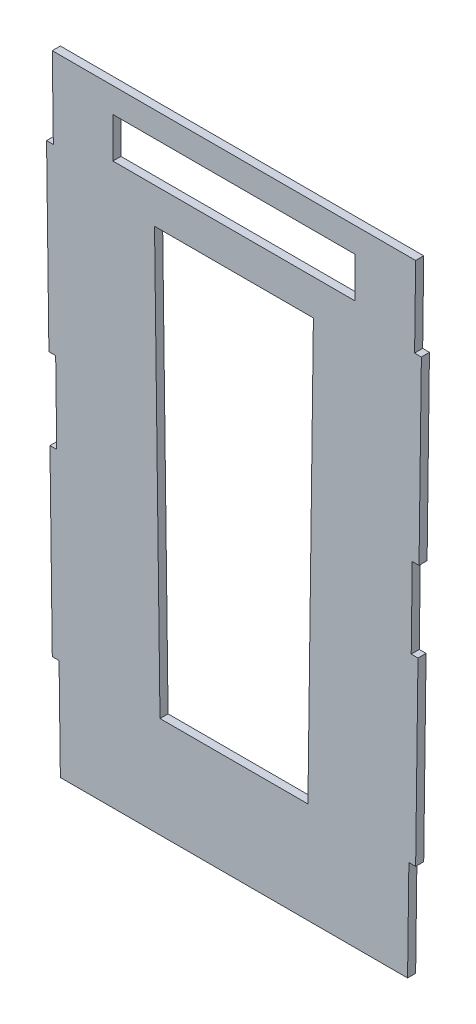
ISO-10303-21;
HEADER;
FILE_DESCRIPTION(('STEP AP214'),'2;1');
FILE_NAME('part.step','',(''),(''),'','','');
FILE_SCHEMA(('AUTOMOTIVE_DESIGN { 1 0 10303 214 1 1 1 1 }'));
ENDSEC;
DATA;
#1=APPLICATION_CONTEXT('core data for automotive mechanical design processes');
#2=APPLICATION_PROTOCOL_DEFINITION('international standard','automotive_design',2000,#1);
#3=PRODUCT_CONTEXT('',#1,'mechanical');
#4=PRODUCT('Part','Part','',(#3));
#5=PRODUCT_RELATED_PRODUCT_CATEGORY('part','',(#4));
#6=PRODUCT_DEFINITION_FORMATION('','',#4);
#7=PRODUCT_DEFINITION_CONTEXT('part definition',#1,'design');
#8=PRODUCT_DEFINITION('design','',#6,#7);
#9=PRODUCT_DEFINITION_SHAPE('','',#8);
#10=(LENGTH_UNIT() NAMED_UNIT(*) SI_UNIT(.MILLI.,.METRE.));
#11=(NAMED_UNIT(*) PLANE_ANGLE_UNIT() SI_UNIT($,.RADIAN.));
#12=(NAMED_UNIT(*) SI_UNIT($,.STERADIAN.) SOLID_ANGLE_UNIT());
#13=UNCERTAINTY_MEASURE_WITH_UNIT(LENGTH_MEASURE(1.E-05),#10,'distance_accuracy_value','');
#14=(GEOMETRIC_REPRESENTATION_CONTEXT(3) GLOBAL_UNCERTAINTY_ASSIGNED_CONTEXT((#13)) GLOBAL_UNIT_ASSIGNED_CONTEXT((#10,
#11,#12)) REPRESENTATION_CONTEXT('',''));
#15=CARTESIAN_POINT('',(0.,0.,0.));
#16=DIRECTION('',(0.,0.,1.));
#17=DIRECTION('',(1.,0.,0.));
#18=AXIS2_PLACEMENT_3D('',#15,#16,#17);
#19=CARTESIAN_POINT('',(-1.61230948984664E-12,-64.9945896453371,2.));
#20=DIRECTION('',(0.,1.,0.));
#21=DIRECTION('',(-1.,0.,0.));
#22=AXIS2_PLACEMENT_3D('',#19,#20,#21);
#23=PLANE('',#22);
#24=DIRECTION('',(1.,0.,0.));
#25=VECTOR('',#24,1.);
#26=CARTESIAN_POINT('',(-1.61230948984664E-12,-64.9945896453371,0.));
#27=LINE('',#26,#25);
#28=CARTESIAN_POINT('',(-0.837659874682009,-64.9945896453371,0.));
#29=VERTEX_POINT('',#28);
#30=CARTESIAN_POINT('',(0.839480171112013,-64.9945896453371,0.));
#31=VERTEX_POINT('',#30);
#32=EDGE_CURVE('E374',#29,#31,#27,.T.);
#33=ORIENTED_EDGE('',*,*,#32,.T.);
#34=DIRECTION('',(0.,0.,-1.));
#35=VECTOR('',#34,1.);
#36=CARTESIAN_POINT('',(0.839480171112013,-64.9945896453371,2.));
#37=LINE('',#36,#35);
#38=CARTESIAN_POINT('',(0.839480171112013,-64.9945896453371,2.));
#39=VERTEX_POINT('',#38);
#40=EDGE_CURVE('E11',#39,#31,#37,.T.);
#41=ORIENTED_EDGE('',*,*,#40,.F.);
#42=DIRECTION('',(1.,0.,0.));
#43=VECTOR('',#42,1.);
#44=CARTESIAN_POINT('',(-1.61230948984664E-12,-64.9945896453371,2.));
#45=LINE('',#44,#43);
#46=CARTESIAN_POINT('',(-0.837659874682009,-64.9945896453371,2.));
#47=VERTEX_POINT('',#46);
#48=EDGE_CURVE('E262',#47,#39,#45,.T.);
#49=ORIENTED_EDGE('',*,*,#48,.F.);
#50=DIRECTION('',(0.,0.,-1.));
#51=VECTOR('',#50,1.);
#52=CARTESIAN_POINT('',(-0.837659874682009,-64.9945896453371,2.));
#53=LINE('',#52,#51);
#54=EDGE_CURVE('E293',#47,#29,#53,.T.);
#55=ORIENTED_EDGE('',*,*,#54,.T.);
#56=EDGE_LOOP('',(#33,#41,#49,#55));
#57=FACE_BOUND('',#56,.T.);
#58=ADVANCED_FACE('F36',(#57),#23,.F.);
#59=CARTESIAN_POINT('',(0.,0.,2.));
#60=DIRECTION('',(-0.999916596909834,-0.0129150774003207,0.));
#61=DIRECTION('',(0.0129150774003207,-0.999916596909834,0.));
#62=AXIS2_PLACEMENT_3D('',#59,#60,#61);
#63=PLANE('',#62);
#64=DIRECTION('',(-0.0129150774003207,0.999916596909834,0.));
#65=VECTOR('',#64,1.);
#66=CARTESIAN_POINT('',(0.,0.,0.));
#67=LINE('',#66,#65);
#68=CARTESIAN_POINT('',(1.09780326406264,-84.9945896453372,0.));
#69=VERTEX_POINT('',#68);
#70=EDGE_CURVE('E377',#69,#31,#67,.T.);
#71=ORIENTED_EDGE('',*,*,#70,.F.);
#72=DIRECTION('',(0.,0.,-1.));
#73=VECTOR('',#72,1.);
#74=CARTESIAN_POINT('',(1.09780326406264,-84.9945896453372,2.));
#75=LINE('',#74,#73);
#76=CARTESIAN_POINT('',(1.09780326406264,-84.9945896453372,2.));
#77=VERTEX_POINT('',#76);
#78=EDGE_CURVE('E46',#77,#69,#75,.T.);
#79=ORIENTED_EDGE('',*,*,#78,.F.);
#80=DIRECTION('',(-0.0129150774003207,0.999916596909834,0.));
#81=VECTOR('',#80,1.);
#82=CARTESIAN_POINT('',(0.,0.,2.));
#83=LINE('',#82,#81);
#84=EDGE_CURVE('E252',#77,#39,#83,.T.);
#85=ORIENTED_EDGE('',*,*,#84,.T.);
#86=ORIENTED_EDGE('',*,*,#40,.T.);
#87=EDGE_LOOP('',(#71,#79,#85,#86));
#88=FACE_BOUND('',#87,.T.);
#89=ADVANCED_FACE('F479',(#88),#63,.T.);
#90=CARTESIAN_POINT('',(0.,-84.9945896453372,2.));
#91=DIRECTION('',(0.,1.,0.));
#92=DIRECTION('',(0.,0.,1.));
#93=AXIS2_PLACEMENT_3D('',#90,#91,#92);
#94=PLANE('',#93);
#95=DIRECTION('',(1.,0.,0.));
#96=VECTOR('',#95,1.);
#97=CARTESIAN_POINT('',(0.,-84.9945896453372,0.));
#98=LINE('',#97,#96);
#99=CARTESIAN_POINT('',(-0.579595356949847,-84.9945896453372,0.));
#100=VERTEX_POINT('',#99);
#101=EDGE_CURVE('E380',#100,#69,#98,.T.);
#102=ORIENTED_EDGE('',*,*,#101,.F.);
#103=DIRECTION('',(0.,0.,-1.));
#104=VECTOR('',#103,1.);
#105=CARTESIAN_POINT('',(-0.579595356949847,-84.9945896453372,2.));
#106=LINE('',#105,#104);
#107=CARTESIAN_POINT('',(-0.579595356949847,-84.9945896453372,2.));
#108=VERTEX_POINT('',#107);
#109=EDGE_CURVE('E325',#108,#100,#106,.T.);
#110=ORIENTED_EDGE('',*,*,#109,.F.);
#111=DIRECTION('',(1.,0.,0.));
#112=VECTOR('',#111,1.);
#113=CARTESIAN_POINT('',(0.,-84.9945896453372,2.));
#114=LINE('',#113,#112);
#115=EDGE_CURVE('E261',#108,#77,#114,.T.);
#116=ORIENTED_EDGE('',*,*,#115,.T.);
#117=ORIENTED_EDGE('',*,*,#78,.T.);
#118=EDGE_LOOP('',(#102,#110,#116,#117));
#119=FACE_BOUND('',#118,.T.);
#120=ADVANCED_FACE('F477',(#119),#94,.T.);
#121=CARTESIAN_POINT('',(-1.67602070016952,-0.0216260736849209,2.));
#122=DIRECTION('',(0.999916763774417,0.0129021518707889,0.));
#123=DIRECTION('',(-0.0129021518707889,0.999916763774417,0.));
#124=AXIS2_PLACEMENT_3D('',#121,#122,#123);
#125=PLANE('',#124);
#126=DIRECTION('',(0.0129021518707889,-0.999916763774417,0.));
#127=VECTOR('',#126,1.);
#128=CARTESIAN_POINT('',(-1.67602070016952,-0.0216260736849209,0.));
#129=LINE('',#128,#127);
#130=CARTESIAN_POINT('',(0.00100147723565425,-129.990844015186,0.));
#131=VERTEX_POINT('',#130);
#132=EDGE_CURVE('E384',#100,#131,#129,.T.);
#133=ORIENTED_EDGE('',*,*,#132,.T.);
#134=DIRECTION('',(0.,0.,-1.));
#135=VECTOR('',#134,1.);
#136=CARTESIAN_POINT('',(0.00100147723565425,-129.990844015186,2.));
#137=LINE('',#136,#135);
#138=CARTESIAN_POINT('',(0.00100147723565425,-129.990844015186,2.));
#139=VERTEX_POINT('',#138);
#140=EDGE_CURVE('E322',#139,#131,#137,.T.);
#141=ORIENTED_EDGE('',*,*,#140,.F.);
#142=DIRECTION('',(0.0129021518707889,-0.999916763774417,0.));
#143=VECTOR('',#142,1.);
#144=CARTESIAN_POINT('',(-1.67602070016952,-0.0216260736849209,2.));
#145=LINE('',#144,#143);
#146=EDGE_CURVE('E266',#108,#139,#145,.T.);
#147=ORIENTED_EDGE('',*,*,#146,.F.);
#148=ORIENTED_EDGE('',*,*,#109,.T.);
#149=EDGE_LOOP('',(#133,#141,#147,#148));
#150=FACE_BOUND('',#149,.T.);
#151=ADVANCED_FACE('F473',(#150),#125,.F.);
#152=CARTESIAN_POINT('',(0.,-129.990844015186,2.));
#153=DIRECTION('',(0.,1.,0.));
#154=DIRECTION('',(0.,0.,1.));
#155=AXIS2_PLACEMENT_3D('',#152,#153,#154);
#156=PLANE('',#155);
#157=DIRECTION('',(1.,0.,0.));
#158=VECTOR('',#157,1.);
#159=CARTESIAN_POINT('',(0.,-129.990844015186,0.));
#160=LINE('',#159,#158);
#161=CARTESIAN_POINT('',(1.67898184406326,-129.990844015186,0.));
#162=VERTEX_POINT('',#161);
#163=EDGE_CURVE('E386',#131,#162,#160,.T.);
#164=ORIENTED_EDGE('',*,*,#163,.T.);
#165=DIRECTION('',(0.,0.,-1.));
#166=VECTOR('',#165,1.);
#167=CARTESIAN_POINT('',(1.67898184406326,-129.990844015186,2.));
#168=LINE('',#167,#166);
#169=CARTESIAN_POINT('',(1.67898184406326,-129.990844015186,2.));
#170=VERTEX_POINT('',#169);
#171=EDGE_CURVE('E320',#170,#162,#168,.T.);
#172=ORIENTED_EDGE('',*,*,#171,.F.);
#173=DIRECTION('',(1.,0.,0.));
#174=VECTOR('',#173,1.);
#175=CARTESIAN_POINT('',(0.,-129.990844015186,2.));
#176=LINE('',#175,#174);
#177=EDGE_CURVE('E259',#139,#170,#176,.T.);
#178=ORIENTED_EDGE('',*,*,#177,.F.);
#179=ORIENTED_EDGE('',*,*,#140,.T.);
#180=EDGE_LOOP('',(#164,#172,#178,#179));
#181=FACE_BOUND('',#180,.T.);
#182=ADVANCED_FACE('F469',(#181),#156,.F.);
#183=CARTESIAN_POINT('',(2.00100147723566,-154.922384551822,0.));
#184=VERTEX_POINT('',#183);
#185=EDGE_CURVE('E381',#184,#162,#67,.T.);
#186=ORIENTED_EDGE('',*,*,#185,.F.);
#187=DIRECTION('',(0.,0.,-1.));
#188=VECTOR('',#187,1.);
#189=CARTESIAN_POINT('',(2.00100147723566,-154.922384551822,2.));
#190=LINE('',#189,#188);
#191=CARTESIAN_POINT('',(2.00100147723566,-154.922384551822,2.));
#192=VERTEX_POINT('',#191);
#193=EDGE_CURVE('E318',#192,#184,#190,.T.);
#194=ORIENTED_EDGE('',*,*,#193,.F.);
#195=EDGE_CURVE('E251',#192,#170,#83,.T.);
#196=ORIENTED_EDGE('',*,*,#195,.T.);
#197=ORIENTED_EDGE('',*,*,#171,.T.);
#198=EDGE_LOOP('',(#186,#194,#196,#197));
#199=FACE_BOUND('',#198,.T.);
#200=ADVANCED_FACE('F464',(#199),#63,.T.);
#201=CARTESIAN_POINT('',(0.,-154.922384551822,2.));
#202=DIRECTION('',(0.,-1.,0.));
#203=DIRECTION('',(0.,0.,-1.));
#204=AXIS2_PLACEMENT_3D('',#201,#202,#203);
#205=PLANE('',#204);
#206=DIRECTION('',(-1.,0.,0.));
#207=VECTOR('',#206,1.);
#208=CARTESIAN_POINT('',(0.,-154.922384551822,0.));
#209=LINE('',#208,#207);
#210=CARTESIAN_POINT('',(88.0010014772356,-154.922384551822,0.));
#211=VERTEX_POINT('',#210);
#212=EDGE_CURVE('E389',#211,#184,#209,.T.);
#213=ORIENTED_EDGE('',*,*,#212,.F.);
#214=DIRECTION('',(0.,0.,-1.));
#215=VECTOR('',#214,1.);
#216=CARTESIAN_POINT('',(88.0010014772356,-154.922384551822,2.));
#217=LINE('',#216,#215);
#218=CARTESIAN_POINT('',(88.0010014772356,-154.922384551822,2.));
#219=VERTEX_POINT('',#218);
#220=EDGE_CURVE('E316',#219,#211,#217,.T.);
#221=ORIENTED_EDGE('',*,*,#220,.F.);
#222=DIRECTION('',(-1.,0.,0.));
#223=VECTOR('',#222,1.);
#224=CARTESIAN_POINT('',(0.,-154.922384551822,2.));
#225=LINE('',#224,#223);
#226=EDGE_CURVE('E258',#219,#192,#225,.T.);
#227=ORIENTED_EDGE('',*,*,#226,.T.);
#228=ORIENTED_EDGE('',*,*,#193,.T.);
#229=EDGE_LOOP('',(#213,#221,#227,#228));
#230=FACE_BOUND('',#229,.T.);
#231=ADVANCED_FACE('F458',(#230),#205,.T.);
#232=CARTESIAN_POINT('',(89.9850181029393,-1.16109701499287,2.));
#233=DIRECTION('',(0.999916763774417,-0.0129021518707889,0.));
#234=DIRECTION('',(0.0129021518707889,0.999916763774417,0.));
#235=AXIS2_PLACEMENT_3D('',#232,#233,#234);
#236=PLANE('',#235);
#237=DIRECTION('',(-0.0129021518707889,-0.999916763774417,0.));
#238=VECTOR('',#237,1.);
#239=CARTESIAN_POINT('',(89.9850181029393,-1.16109701499287,0.));
#240=LINE('',#239,#238);
#241=CARTESIAN_POINT('',(88.322698776481,-129.990844015186,0.));
#242=VERTEX_POINT('',#241);
#243=EDGE_CURVE('E392',#242,#211,#240,.T.);
#244=ORIENTED_EDGE('',*,*,#243,.F.);
#245=DIRECTION('',(0.,0.,-1.));
#246=VECTOR('',#245,1.);
#247=CARTESIAN_POINT('',(88.322698776481,-129.990844015186,2.));
#248=LINE('',#247,#246);
#249=CARTESIAN_POINT('',(88.322698776481,-129.990844015186,2.));
#250=VERTEX_POINT('',#249);
#251=EDGE_CURVE('E314',#250,#242,#248,.T.);
#252=ORIENTED_EDGE('',*,*,#251,.F.);
#253=DIRECTION('',(-0.0129021518707889,-0.999916763774417,0.));
#254=VECTOR('',#253,1.);
#255=CARTESIAN_POINT('',(89.9850181029393,-1.16109701499287,2.));
#256=LINE('',#255,#254);
#257=EDGE_CURVE('E454',#250,#219,#256,.T.);
#258=ORIENTED_EDGE('',*,*,#257,.T.);
#259=ORIENTED_EDGE('',*,*,#220,.T.);
#260=EDGE_LOOP('',(#244,#252,#258,#259));
#261=FACE_BOUND('',#260,.T.);
#262=ADVANCED_FACE('F452',(#261),#236,.T.);
#263=CARTESIAN_POINT('',(0.,-129.990844015186,2.));
#264=DIRECTION('',(0.,-1.,0.));
#265=DIRECTION('',(0.,0.,-1.));
#266=AXIS2_PLACEMENT_3D('',#263,#264,#265);
#267=PLANE('',#266);
#268=DIRECTION('',(-1.,0.,0.));
#269=VECTOR('',#268,1.);
#270=CARTESIAN_POINT('',(0.,-129.990844015186,0.));
#271=LINE('',#270,#269);
#272=CARTESIAN_POINT('',(90.0010014772356,-129.990844015186,0.));
#273=VERTEX_POINT('',#272);
#274=EDGE_CURVE('E395',#273,#242,#271,.T.);
#275=ORIENTED_EDGE('',*,*,#274,.F.);
#276=DIRECTION('',(0.,0.,-1.));
#277=VECTOR('',#276,1.);
#278=CARTESIAN_POINT('',(90.0010014772356,-129.990844015186,2.));
#279=LINE('',#278,#277);
#280=CARTESIAN_POINT('',(90.0010014772356,-129.990844015186,2.));
#281=VERTEX_POINT('',#280);
#282=EDGE_CURVE('E312',#281,#273,#279,.T.);
#283=ORIENTED_EDGE('',*,*,#282,.F.);
#284=DIRECTION('',(-1.,0.,0.));
#285=VECTOR('',#284,1.);
#286=CARTESIAN_POINT('',(0.,-129.990844015186,2.));
#287=LINE('',#286,#285);
#288=EDGE_CURVE('E448',#281,#250,#287,.T.);
#289=ORIENTED_EDGE('',*,*,#288,.T.);
#290=ORIENTED_EDGE('',*,*,#251,.T.);
#291=EDGE_LOOP('',(#275,#283,#289,#290));
#292=FACE_BOUND('',#291,.T.);
#293=ADVANCED_FACE('F445',(#292),#267,.T.);
#294=CARTESIAN_POINT('',(91.6630414241572,-1.18274892894955,2.));
#295=DIRECTION('',(0.999916763774417,-0.0129021518707889,0.));
#296=DIRECTION('',(0.0129021518707889,0.999916763774417,0.));
#297=AXIS2_PLACEMENT_3D('',#294,#295,#296);
#298=PLANE('',#297);
#299=DIRECTION('',(-0.0129021518707889,-0.999916763774417,0.));
#300=VECTOR('',#299,1.);
#301=CARTESIAN_POINT('',(91.6630414241572,-1.18274892894955,0.));
#302=LINE('',#301,#300);
#303=CARTESIAN_POINT('',(90.5815983114211,-84.9945896453371,0.));
#304=VERTEX_POINT('',#303);
#305=EDGE_CURVE('E400',#304,#273,#302,.T.);
#306=ORIENTED_EDGE('',*,*,#305,.F.);
#307=DIRECTION('',(0.,0.,-1.));
#308=VECTOR('',#307,1.);
#309=CARTESIAN_POINT('',(90.5815983114211,-84.9945896453371,2.));
#310=LINE('',#309,#308);
#311=CARTESIAN_POINT('',(90.5815983114211,-84.9945896453371,2.));
#312=VERTEX_POINT('',#311);
#313=EDGE_CURVE('E310',#312,#304,#310,.T.);
#314=ORIENTED_EDGE('',*,*,#313,.F.);
#315=DIRECTION('',(-0.0129021518707889,-0.999916763774417,0.));
#316=VECTOR('',#315,1.);
#317=CARTESIAN_POINT('',(91.6630414241572,-1.18274892894955,2.));
#318=LINE('',#317,#316);
#319=EDGE_CURVE('E441',#312,#281,#318,.T.);
#320=ORIENTED_EDGE('',*,*,#319,.T.);
#321=ORIENTED_EDGE('',*,*,#282,.T.);
#322=EDGE_LOOP('',(#306,#314,#320,#321));
#323=FACE_BOUND('',#322,.T.);
#324=ADVANCED_FACE('F440',(#323),#298,.T.);
#325=CARTESIAN_POINT('',(0.,-84.9945896453371,2.));
#326=DIRECTION('',(0.,-1.,0.));
#327=DIRECTION('',(0.,0.,-1.));
#328=AXIS2_PLACEMENT_3D('',#325,#326,#327);
#329=PLANE('',#328);
#330=DIRECTION('',(-1.,0.,0.));
#331=VECTOR('',#330,1.);
#332=CARTESIAN_POINT('',(0.,-84.9945896453371,0.));
#333=LINE('',#332,#331);
#334=CARTESIAN_POINT('',(88.9032956106665,-84.9945896453371,0.));
#335=VERTEX_POINT('',#334);
#336=EDGE_CURVE('E403',#304,#335,#333,.T.);
#337=ORIENTED_EDGE('',*,*,#336,.T.);
#338=DIRECTION('',(0.,0.,-1.));
#339=VECTOR('',#338,1.);
#340=CARTESIAN_POINT('',(88.9032956106665,-84.9945896453371,2.));
#341=LINE('',#340,#339);
#342=CARTESIAN_POINT('',(88.9032956106665,-84.9945896453371,2.));
#343=VERTEX_POINT('',#342);
#344=EDGE_CURVE('E308',#343,#335,#341,.T.);
#345=ORIENTED_EDGE('',*,*,#344,.F.);
#346=DIRECTION('',(-1.,0.,0.));
#347=VECTOR('',#346,1.);
#348=CARTESIAN_POINT('',(0.,-84.9945896453371,2.));
#349=LINE('',#348,#347);
#350=EDGE_CURVE('E436',#312,#343,#349,.T.);
#351=ORIENTED_EDGE('',*,*,#350,.F.);
#352=ORIENTED_EDGE('',*,*,#313,.T.);
#353=EDGE_LOOP('',(#337,#345,#351,#352));
#354=FACE_BOUND('',#353,.T.);
#355=ADVANCED_FACE('F435',(#354),#329,.F.);
#356=CARTESIAN_POINT('',(89.1613601283987,-64.9945896453371,0.));
#357=VERTEX_POINT('',#356);
#358=EDGE_CURVE('E397',#357,#335,#240,.T.);
#359=ORIENTED_EDGE('',*,*,#358,.F.);
#360=DIRECTION('',(0.,0.,-1.));
#361=VECTOR('',#360,1.);
#362=CARTESIAN_POINT('',(89.1613601283987,-64.9945896453371,2.));
#363=LINE('',#362,#361);
#364=CARTESIAN_POINT('',(89.1613601283987,-64.9945896453371,2.));
#365=VERTEX_POINT('',#364);
#366=EDGE_CURVE('E306',#365,#357,#363,.T.);
#367=ORIENTED_EDGE('',*,*,#366,.F.);
#368=EDGE_CURVE('E432',#365,#343,#256,.T.);
#369=ORIENTED_EDGE('',*,*,#368,.T.);
#370=ORIENTED_EDGE('',*,*,#344,.T.);
#371=EDGE_LOOP('',(#359,#367,#369,#370));
#372=FACE_BOUND('',#371,.T.);
#373=ADVANCED_FACE('F428',(#372),#236,.T.);
#374=CARTESIAN_POINT('',(-5.37436496615532E-13,-64.9945896453364,2.));
#375=DIRECTION('',(0.,-1.,0.));
#376=DIRECTION('',(1.,0.,0.));
#377=AXIS2_PLACEMENT_3D('',#374,#375,#376);
#378=PLANE('',#377);
#379=DIRECTION('',(-1.,0.,0.));
#380=VECTOR('',#379,1.);
#381=CARTESIAN_POINT('',(-5.37436496615532E-13,-64.9945896453364,0.));
#382=LINE('',#381,#380);
#383=CARTESIAN_POINT('',(90.8396628291533,-64.9945896453371,0.));
#384=VERTEX_POINT('',#383);
#385=EDGE_CURVE('E406',#384,#357,#382,.T.);
#386=ORIENTED_EDGE('',*,*,#385,.F.);
#387=DIRECTION('',(0.,0.,-1.));
#388=VECTOR('',#387,1.);
#389=CARTESIAN_POINT('',(90.8396628291533,-64.9945896453371,2.));
#390=LINE('',#389,#388);
#391=CARTESIAN_POINT('',(90.8396628291533,-64.9945896453371,2.));
#392=VERTEX_POINT('',#391);
#393=EDGE_CURVE('E304',#392,#384,#390,.T.);
#394=ORIENTED_EDGE('',*,*,#393,.F.);
#395=DIRECTION('',(-1.,0.,0.));
#396=VECTOR('',#395,1.);
#397=CARTESIAN_POINT('',(-5.37436496615532E-13,-64.9945896453364,2.));
#398=LINE('',#397,#396);
#399=EDGE_CURVE('E807',#392,#365,#398,.T.);
#400=ORIENTED_EDGE('',*,*,#399,.T.);
#401=ORIENTED_EDGE('',*,*,#366,.T.);
#402=EDGE_LOOP('',(#386,#394,#400,#401));
#403=FACE_BOUND('',#402,.T.);
#404=ADVANCED_FACE('F580',(#403),#378,.T.);
#405=CARTESIAN_POINT('',(91.6630414241572,-1.18274892894952,2.));
#406=DIRECTION('',(0.999916763774417,-0.0129021518707886,0.));
#407=DIRECTION('',(0.0129021518707886,0.999916763774417,0.));
#408=AXIS2_PLACEMENT_3D('',#405,#406,#407);
#409=PLANE('',#408);
#410=DIRECTION('',(-0.0129021518707886,-0.999916763774417,0.));
#411=VECTOR('',#410,1.);
#412=CARTESIAN_POINT('',(91.6630414241572,-1.18274892894952,0.));
#413=LINE('',#412,#411);
#414=CARTESIAN_POINT('',(91.4202596633388,-19.9983352754883,0.));
#415=VERTEX_POINT('',#414);
#416=EDGE_CURVE('E409',#415,#384,#413,.T.);
#417=ORIENTED_EDGE('',*,*,#416,.F.);
#418=DIRECTION('',(0.,0.,-1.));
#419=VECTOR('',#418,1.);
#420=CARTESIAN_POINT('',(91.4202596633388,-19.9983352754883,2.));
#421=LINE('',#420,#419);
#422=CARTESIAN_POINT('',(91.4202596633388,-19.9983352754883,2.));
#423=VERTEX_POINT('',#422);
#424=EDGE_CURVE('E302',#423,#415,#421,.T.);
#425=ORIENTED_EDGE('',*,*,#424,.F.);
#426=DIRECTION('',(-0.0129021518707886,-0.999916763774417,0.));
#427=VECTOR('',#426,1.);
#428=CARTESIAN_POINT('',(91.6630414241572,-1.18274892894952,2.));
#429=LINE('',#428,#427);
#430=EDGE_CURVE('E803',#423,#392,#429,.T.);
#431=ORIENTED_EDGE('',*,*,#430,.T.);
#432=ORIENTED_EDGE('',*,*,#393,.T.);
#433=EDGE_LOOP('',(#417,#425,#431,#432));
#434=FACE_BOUND('',#433,.T.);
#435=ADVANCED_FACE('F572',(#434),#409,.T.);
#436=CARTESIAN_POINT('',(0.,-19.9983352754883,2.));
#437=DIRECTION('',(0.,1.,0.));
#438=DIRECTION('',(0.,0.,1.));
#439=AXIS2_PLACEMENT_3D('',#436,#437,#438);
#440=PLANE('',#439);
#441=DIRECTION('',(1.,0.,0.));
#442=VECTOR('',#441,1.);
#443=CARTESIAN_POINT('',(0.,-19.9983352754883,0.));
#444=LINE('',#443,#442);
#445=CARTESIAN_POINT('',(89.7419569625842,-19.9983352754883,0.));
#446=VERTEX_POINT('',#445);
#447=EDGE_CURVE('E412',#446,#415,#444,.T.);
#448=ORIENTED_EDGE('',*,*,#447,.F.);
#449=DIRECTION('',(0.,0.,-1.));
#450=VECTOR('',#449,1.);
#451=CARTESIAN_POINT('',(89.7419569625842,-19.9983352754883,2.));
#452=LINE('',#451,#450);
#453=CARTESIAN_POINT('',(89.7419569625842,-19.9983352754883,2.));
#454=VERTEX_POINT('',#453);
#455=EDGE_CURVE('E300',#454,#446,#452,.T.);
#456=ORIENTED_EDGE('',*,*,#455,.F.);
#457=DIRECTION('',(1.,0.,0.));
#458=VECTOR('',#457,1.);
#459=CARTESIAN_POINT('',(0.,-19.9983352754883,2.));
#460=LINE('',#459,#458);
#461=EDGE_CURVE('E806',#454,#423,#460,.T.);
#462=ORIENTED_EDGE('',*,*,#461,.T.);
#463=ORIENTED_EDGE('',*,*,#424,.T.);
#464=EDGE_LOOP('',(#448,#456,#462,#463));
#465=FACE_BOUND('',#464,.T.);
#466=ADVANCED_FACE('F564',(#465),#440,.T.);
#467=CARTESIAN_POINT('',(90.,0.,0.));
#468=VERTEX_POINT('',#467);
#469=EDGE_CURVE('E396',#468,#446,#240,.T.);
#470=ORIENTED_EDGE('',*,*,#469,.F.);
#471=DIRECTION('',(0.,0.,-1.));
#472=VECTOR('',#471,1.);
#473=CARTESIAN_POINT('',(90.,0.,2.));
#474=LINE('',#473,#472);
#475=CARTESIAN_POINT('',(90.,0.,2.));
#476=VERTEX_POINT('',#475);
#477=EDGE_CURVE('E298',#476,#468,#474,.T.);
#478=ORIENTED_EDGE('',*,*,#477,.F.);
#479=EDGE_CURVE('E253',#476,#454,#256,.T.);
#480=ORIENTED_EDGE('',*,*,#479,.T.);
#481=ORIENTED_EDGE('',*,*,#455,.T.);
#482=EDGE_LOOP('',(#470,#478,#480,#481));
#483=FACE_BOUND('',#482,.T.);
#484=ADVANCED_FACE('F556',(#483),#236,.T.);
#485=CARTESIAN_POINT('',(0.,0.,2.));
#486=DIRECTION('',(0.,1.,0.));
#487=DIRECTION('',(0.,0.,1.));
#488=AXIS2_PLACEMENT_3D('',#485,#486,#487);
#489=PLANE('',#488);
#490=DIRECTION('',(1.,0.,0.));
#491=VECTOR('',#490,1.);
#492=CARTESIAN_POINT('',(0.,0.,0.));
#493=LINE('',#492,#491);
#494=CARTESIAN_POINT('',(0.,0.,0.));
#495=VERTEX_POINT('',#494);
#496=EDGE_CURVE('E414',#495,#468,#493,.T.);
#497=ORIENTED_EDGE('',*,*,#496,.F.);
#498=DIRECTION('',(0.,0.,-1.));
#499=VECTOR('',#498,1.);
#500=CARTESIAN_POINT('',(0.,0.,2.));
#501=LINE('',#500,#499);
#502=CARTESIAN_POINT('',(0.,0.,2.));
#503=VERTEX_POINT('',#502);
#504=EDGE_CURVE('E239',#503,#495,#501,.T.);
#505=ORIENTED_EDGE('',*,*,#504,.F.);
#506=DIRECTION('',(1.,0.,0.));
#507=VECTOR('',#506,1.);
#508=CARTESIAN_POINT('',(0.,0.,2.));
#509=LINE('',#508,#507);
#510=EDGE_CURVE('E249',#503,#476,#509,.T.);
#511=ORIENTED_EDGE('',*,*,#510,.T.);
#512=ORIENTED_EDGE('',*,*,#477,.T.);
#513=EDGE_LOOP('',(#497,#505,#511,#512));
#514=FACE_BOUND('',#513,.T.);
#515=ADVANCED_FACE('F550',(#514),#489,.T.);
#516=CARTESIAN_POINT('',(0.25830159111139,-19.9983352754885,0.));
#517=VERTEX_POINT('',#516);
#518=EDGE_CURVE('E238',#517,#495,#67,.T.);
#519=ORIENTED_EDGE('',*,*,#518,.F.);
#520=DIRECTION('',(0.,0.,-1.));
#521=VECTOR('',#520,1.);
#522=CARTESIAN_POINT('',(0.25830159111139,-19.9983352754885,2.));
#523=LINE('',#522,#521);
#524=CARTESIAN_POINT('',(0.25830159111139,-19.9983352754885,2.));
#525=VERTEX_POINT('',#524);
#526=EDGE_CURVE('E232',#525,#517,#523,.T.);
#527=ORIENTED_EDGE('',*,*,#526,.F.);
#528=EDGE_CURVE('E236',#525,#503,#83,.T.);
#529=ORIENTED_EDGE('',*,*,#528,.T.);
#530=ORIENTED_EDGE('',*,*,#504,.T.);
#531=EDGE_LOOP('',(#519,#527,#529,#530));
#532=FACE_BOUND('',#531,.T.);
#533=ADVANCED_FACE('F234',(#532),#63,.T.);
#534=CARTESIAN_POINT('',(-1.32292060705367E-12,-19.9983352754884,2.));
#535=DIRECTION('',(0.,-1.,0.));
#536=DIRECTION('',(1.,0.,0.));
#537=AXIS2_PLACEMENT_3D('',#534,#535,#536);
#538=PLANE('',#537);
#539=DIRECTION('',(-1.,0.,0.));
#540=VECTOR('',#539,1.);
#541=CARTESIAN_POINT('',(-1.32292060705367E-12,-19.9983352754884,0.));
#542=LINE('',#541,#540);
#543=CARTESIAN_POINT('',(-1.4182567088675,-19.9983352754883,0.));
#544=VERTEX_POINT('',#543);
#545=EDGE_CURVE('E142',#517,#544,#542,.T.);
#546=ORIENTED_EDGE('',*,*,#545,.T.);
#547=DIRECTION('',(0.,0.,-1.));
#548=VECTOR('',#547,1.);
#549=CARTESIAN_POINT('',(-1.4182567088675,-19.9983352754883,2.));
#550=LINE('',#549,#548);
#551=CARTESIAN_POINT('',(-1.4182567088675,-19.9983352754883,2.));
#552=VERTEX_POINT('',#551);
#553=EDGE_CURVE('E240',#552,#544,#550,.T.);
#554=ORIENTED_EDGE('',*,*,#553,.F.);
#555=DIRECTION('',(-1.,0.,0.));
#556=VECTOR('',#555,1.);
#557=CARTESIAN_POINT('',(-1.32292060705367E-12,-19.9983352754884,2.));
#558=LINE('',#557,#556);
#559=EDGE_CURVE('E242',#525,#552,#558,.T.);
#560=ORIENTED_EDGE('',*,*,#559,.F.);
#561=ORIENTED_EDGE('',*,*,#526,.T.);
#562=EDGE_LOOP('',(#546,#554,#560,#561));
#563=FACE_BOUND('',#562,.T.);
#564=ADVANCED_FACE('F243',(#563),#538,.F.);
#565=CARTESIAN_POINT('',(75.0010014772356,0.,2.));
#566=DIRECTION('',(1.,0.,0.));
#567=DIRECTION('',(0.,0.,-1.));
#568=AXIS2_PLACEMENT_3D('',#565,#566,#567);
#569=PLANE('',#568);
#570=DIRECTION('',(0.,-1.,0.));
#571=VECTOR('',#570,1.);
#572=CARTESIAN_POINT('',(75.0010014772356,0.,0.));
#573=LINE('',#572,#571);
#574=CARTESIAN_POINT('',(75.0010014772356,-6.17699648101856,0.));
#575=VERTEX_POINT('',#574);
#576=CARTESIAN_POINT('',(75.0010014772356,-16.1769964810186,0.));
#577=VERTEX_POINT('',#576);
#578=EDGE_CURVE('E363',#575,#577,#573,.T.);
#579=ORIENTED_EDGE('',*,*,#578,.T.);
#580=DIRECTION('',(0.,0.,-1.));
#581=VECTOR('',#580,1.);
#582=CARTESIAN_POINT('',(75.0010014772356,-16.1769964810186,2.));
#583=LINE('',#582,#581);
#584=CARTESIAN_POINT('',(75.0010014772356,-16.1769964810186,2.));
#585=VERTEX_POINT('',#584);
#586=EDGE_CURVE('E295',#585,#577,#583,.T.);
#587=ORIENTED_EDGE('',*,*,#586,.F.);
#588=DIRECTION('',(0.,-1.,0.));
#589=VECTOR('',#588,1.);
#590=CARTESIAN_POINT('',(75.0010014772356,0.,2.));
#591=LINE('',#590,#589);
#592=CARTESIAN_POINT('',(75.0010014772356,-6.17699648101856,2.));
#593=VERTEX_POINT('',#592);
#594=EDGE_CURVE('E278',#593,#585,#591,.T.);
#595=ORIENTED_EDGE('',*,*,#594,.F.);
#596=DIRECTION('',(0.,0.,-1.));
#597=VECTOR('',#596,1.);
#598=CARTESIAN_POINT('',(75.0010014772356,-6.17699648101856,2.));
#599=LINE('',#598,#597);
#600=EDGE_CURVE('E328',#593,#575,#599,.T.);
#601=ORIENTED_EDGE('',*,*,#600,.T.);
#602=EDGE_LOOP('',(#579,#587,#595,#601));
#603=FACE_BOUND('',#602,.T.);
#604=ADVANCED_FACE('F515',(#603),#569,.F.);
#605=CARTESIAN_POINT('',(0.,-16.1769964810186,2.));
#606=DIRECTION('',(0.,1.,0.));
#607=DIRECTION('',(0.,0.,1.));
#608=AXIS2_PLACEMENT_3D('',#605,#606,#607);
#609=PLANE('',#608);
#610=DIRECTION('',(1.,0.,0.));
#611=VECTOR('',#610,1.);
#612=CARTESIAN_POINT('',(0.,-16.1769964810186,0.));
#613=LINE('',#612,#611);
#614=CARTESIAN_POINT('',(15.0010014772357,-16.1769964810186,0.));
#615=VERTEX_POINT('',#614);
#616=EDGE_CURVE('E366',#615,#577,#613,.T.);
#617=ORIENTED_EDGE('',*,*,#616,.F.);
#618=DIRECTION('',(0.,0.,-1.));
#619=VECTOR('',#618,1.);
#620=CARTESIAN_POINT('',(15.0010014772357,-16.1769964810186,2.));
#621=LINE('',#620,#619);
#622=CARTESIAN_POINT('',(15.0010014772357,-16.1769964810186,2.));
#623=VERTEX_POINT('',#622);
#624=EDGE_CURVE('E333',#623,#615,#621,.T.);
#625=ORIENTED_EDGE('',*,*,#624,.F.);
#626=DIRECTION('',(1.,0.,0.));
#627=VECTOR('',#626,1.);
#628=CARTESIAN_POINT('',(0.,-16.1769964810186,2.));
#629=LINE('',#628,#627);
#630=EDGE_CURVE('E275',#623,#585,#629,.T.);
#631=ORIENTED_EDGE('',*,*,#630,.T.);
#632=ORIENTED_EDGE('',*,*,#586,.T.);
#633=EDGE_LOOP('',(#617,#625,#631,#632));
#634=FACE_BOUND('',#633,.T.);
#635=ADVANCED_FACE('F511',(#634),#609,.T.);
#636=CARTESIAN_POINT('',(15.0010014772357,0.,2.));
#637=DIRECTION('',(1.,0.,0.));
#638=DIRECTION('',(0.,1.,0.));
#639=AXIS2_PLACEMENT_3D('',#636,#637,#638);
#640=PLANE('',#639);
#641=DIRECTION('',(0.,-1.,0.));
#642=VECTOR('',#641,1.);
#643=CARTESIAN_POINT('',(15.0010014772357,0.,0.));
#644=LINE('',#643,#642);
#645=CARTESIAN_POINT('',(15.0010014772357,-6.17699648101856,0.));
#646=VERTEX_POINT('',#645);
#647=EDGE_CURVE('E369',#646,#615,#644,.T.);
#648=ORIENTED_EDGE('',*,*,#647,.F.);
#649=DIRECTION('',(0.,0.,-1.));
#650=VECTOR('',#649,1.);
#651=CARTESIAN_POINT('',(15.0010014772357,-6.17699648101856,2.));
#652=LINE('',#651,#650);
#653=CARTESIAN_POINT('',(15.0010014772357,-6.17699648101856,2.));
#654=VERTEX_POINT('',#653);
#655=EDGE_CURVE('E331',#654,#646,#652,.T.);
#656=ORIENTED_EDGE('',*,*,#655,.F.);
#657=DIRECTION('',(0.,-1.,0.));
#658=VECTOR('',#657,1.);
#659=CARTESIAN_POINT('',(15.0010014772357,0.,2.));
#660=LINE('',#659,#658);
#661=EDGE_CURVE('E270',#654,#623,#660,.T.);
#662=ORIENTED_EDGE('',*,*,#661,.T.);
#663=ORIENTED_EDGE('',*,*,#624,.T.);
#664=EDGE_LOOP('',(#648,#656,#662,#663));
#665=FACE_BOUND('',#664,.T.);
#666=ADVANCED_FACE('F508',(#665),#640,.T.);
#667=CARTESIAN_POINT('',(64.9870990085788,-0.838543218223146,2.));
#668=DIRECTION('',(0.999916763774417,-0.0129021518707888,0.));
#669=DIRECTION('',(0.0129021518707888,0.999916763774417,0.));
#670=AXIS2_PLACEMENT_3D('',#667,#668,#669);
#671=PLANE('',#670);
#672=DIRECTION('',(-0.0129021518707888,-0.999916763774417,0.));
#673=VECTOR('',#672,1.);
#674=CARTESIAN_POINT('',(64.9870990085788,-0.838543218223146,0.));
#675=LINE('',#674,#673);
#676=CARTESIAN_POINT('',(64.675338273974,-25.,0.));
#677=VERTEX_POINT('',#676);
#678=CARTESIAN_POINT('',(63.3215010455402,-129.922384551822,0.));
#679=VERTEX_POINT('',#678);
#680=EDGE_CURVE('E351',#677,#679,#675,.T.);
#681=ORIENTED_EDGE('',*,*,#680,.T.);
#682=DIRECTION('',(0.,0.,-1.));
#683=VECTOR('',#682,1.);
#684=CARTESIAN_POINT('',(63.3215010455402,-129.922384551822,2.));
#685=LINE('',#684,#683);
#686=CARTESIAN_POINT('',(63.3215010455402,-129.922384551822,2.));
#687=VERTEX_POINT('',#686);
#688=EDGE_CURVE('E40',#687,#679,#685,.T.);
#689=ORIENTED_EDGE('',*,*,#688,.F.);
#690=DIRECTION('',(-0.0129021518707888,-0.999916763774417,0.));
#691=VECTOR('',#690,1.);
#692=CARTESIAN_POINT('',(64.9870990085788,-0.838543218223146,2.));
#693=LINE('',#692,#691);
#694=CARTESIAN_POINT('',(64.675338273974,-25.,2.));
#695=VERTEX_POINT('',#694);
#696=EDGE_CURVE('E285',#695,#687,#693,.T.);
#697=ORIENTED_EDGE('',*,*,#696,.F.);
#698=DIRECTION('',(0.,0.,-1.));
#699=VECTOR('',#698,1.);
#700=CARTESIAN_POINT('',(64.675338273974,-25.,2.));
#701=LINE('',#700,#699);
#702=EDGE_CURVE('E336',#695,#677,#701,.T.);
#703=ORIENTED_EDGE('',*,*,#702,.T.);
#704=EDGE_LOOP('',(#681,#689,#697,#703));
#705=FACE_BOUND('',#704,.T.);
#706=ADVANCED_FACE('F38',(#705),#671,.F.);
#707=CARTESIAN_POINT('',(0.,-129.922384551822,2.));
#708=DIRECTION('',(0.,-1.,0.));
#709=DIRECTION('',(0.,0.,-1.));
#710=AXIS2_PLACEMENT_3D('',#707,#708,#709);
#711=PLANE('',#710);
#712=DIRECTION('',(-1.,0.,0.));
#713=VECTOR('',#712,1.);
#714=CARTESIAN_POINT('',(0.,-129.922384551822,0.));
#715=LINE('',#714,#713);
#716=CARTESIAN_POINT('',(26.6801828622179,-129.922384551822,0.));
#717=VERTEX_POINT('',#716);
#718=EDGE_CURVE('E348',#679,#717,#715,.T.);
#719=ORIENTED_EDGE('',*,*,#718,.T.);
#720=DIRECTION('',(0.,0.,-1.));
#721=VECTOR('',#720,1.);
#722=CARTESIAN_POINT('',(26.6801828622179,-129.922384551822,2.));
#723=LINE('',#722,#721);
#724=CARTESIAN_POINT('',(26.6801828622179,-129.922384551822,2.));
#725=VERTEX_POINT('',#724);
#726=EDGE_CURVE('E341',#725,#717,#723,.T.);
#727=ORIENTED_EDGE('',*,*,#726,.F.);
#728=DIRECTION('',(-1.,0.,0.));
#729=VECTOR('',#728,1.);
#730=CARTESIAN_POINT('',(0.,-129.922384551822,2.));
#731=LINE('',#730,#729);
#732=EDGE_CURVE('E157',#687,#725,#731,.T.);
#733=ORIENTED_EDGE('',*,*,#732,.F.);
#734=ORIENTED_EDGE('',*,*,#688,.T.);
#735=EDGE_LOOP('',(#719,#727,#733,#734));
#736=FACE_BOUND('',#735,.T.);
#737=ADVANCED_FACE('F347',(#736),#711,.F.);
#738=CARTESIAN_POINT('',(24.9979149227459,0.322876935008016,2.));
#739=DIRECTION('',(-0.999916596909834,-0.0129150774003206,0.));
#740=DIRECTION('',(0.0129150774003206,-0.999916596909834,0.));
#741=AXIS2_PLACEMENT_3D('',#738,#739,#740);
#742=PLANE('',#741);
#743=DIRECTION('',(-0.0129150774003206,0.999916596909834,0.));
#744=VECTOR('',#743,1.);
#745=CARTESIAN_POINT('',(24.9979149227459,0.322876935008016,0.));
#746=LINE('',#745,#744);
#747=CARTESIAN_POINT('',(25.3249891173588,-25.,0.));
#748=VERTEX_POINT('',#747);
#749=EDGE_CURVE('E356',#717,#748,#746,.T.);
#750=ORIENTED_EDGE('',*,*,#749,.T.);
#751=DIRECTION('',(0.,0.,-1.));
#752=VECTOR('',#751,1.);
#753=CARTESIAN_POINT('',(25.3249891173588,-25.,2.));
#754=LINE('',#753,#752);
#755=CARTESIAN_POINT('',(25.3249891173588,-25.,2.));
#756=VERTEX_POINT('',#755);
#757=EDGE_CURVE('E339',#756,#748,#754,.T.);
#758=ORIENTED_EDGE('',*,*,#757,.F.);
#759=DIRECTION('',(-0.0129150774003206,0.999916596909834,0.));
#760=VECTOR('',#759,1.);
#761=CARTESIAN_POINT('',(24.9979149227459,0.322876935008016,2.));
#762=LINE('',#761,#760);
#763=EDGE_CURVE('E282',#725,#756,#762,.T.);
#764=ORIENTED_EDGE('',*,*,#763,.F.);
#765=ORIENTED_EDGE('',*,*,#726,.T.);
#766=EDGE_LOOP('',(#750,#758,#764,#765));
#767=FACE_BOUND('',#766,.T.);
#768=ADVANCED_FACE('F506',(#767),#742,.F.);
#769=CARTESIAN_POINT('',(0.,-6.17699648101856,2.));
#770=DIRECTION('',(0.,1.,0.));
#771=DIRECTION('',(0.,0.,1.));
#772=AXIS2_PLACEMENT_3D('',#769,#770,#771);
#773=PLANE('',#772);
#774=DIRECTION('',(1.,0.,0.));
#775=VECTOR('',#774,1.);
#776=CARTESIAN_POINT('',(0.,-6.17699648101856,0.));
#777=LINE('',#776,#775);
#778=EDGE_CURVE('E372',#646,#575,#777,.T.);
#779=ORIENTED_EDGE('',*,*,#778,.T.);
#780=ORIENTED_EDGE('',*,*,#600,.F.);
#781=DIRECTION('',(1.,0.,0.));
#782=VECTOR('',#781,1.);
#783=CARTESIAN_POINT('',(0.,-6.17699648101856,2.));
#784=LINE('',#783,#782);
#785=EDGE_CURVE('E267',#654,#593,#784,.T.);
#786=ORIENTED_EDGE('',*,*,#785,.F.);
#787=ORIENTED_EDGE('',*,*,#655,.T.);
#788=EDGE_LOOP('',(#779,#780,#786,#787));
#789=FACE_BOUND('',#788,.T.);
#790=ADVANCED_FACE('F490',(#789),#773,.F.);
#791=CARTESIAN_POINT('',(0.,-25.,2.));
#792=DIRECTION('',(0.,1.,0.));
#793=DIRECTION('',(0.,0.,1.));
#794=AXIS2_PLACEMENT_3D('',#791,#792,#793);
#795=PLANE('',#794);
#796=DIRECTION('',(1.,0.,0.));
#797=VECTOR('',#796,1.);
#798=CARTESIAN_POINT('',(0.,-25.,0.));
#799=LINE('',#798,#797);
#800=EDGE_CURVE('E361',#748,#677,#799,.T.);
#801=ORIENTED_EDGE('',*,*,#800,.T.);
#802=ORIENTED_EDGE('',*,*,#702,.F.);
#803=DIRECTION('',(1.,0.,0.));
#804=VECTOR('',#803,1.);
#805=CARTESIAN_POINT('',(0.,-25.,2.));
#806=LINE('',#805,#804);
#807=EDGE_CURVE('E280',#756,#695,#806,.T.);
#808=ORIENTED_EDGE('',*,*,#807,.F.);
#809=ORIENTED_EDGE('',*,*,#757,.T.);
#810=EDGE_LOOP('',(#801,#802,#808,#809));
#811=FACE_BOUND('',#810,.T.);
#812=ADVANCED_FACE('F483',(#811),#795,.F.);
#813=CARTESIAN_POINT('',(-1.67602070016948,-0.0216260736849199,2.));
#814=DIRECTION('',(0.999916763774417,0.0129021518707887,0.));
#815=DIRECTION('',(-0.0129021518707887,0.999916763774417,0.));
#816=AXIS2_PLACEMENT_3D('',#813,#814,#815);
#817=PLANE('',#816);
#818=DIRECTION('',(0.0129021518707887,-0.999916763774417,0.));
#819=VECTOR('',#818,1.);
#820=CARTESIAN_POINT('',(-1.67602070016948,-0.0216260736849199,0.));
#821=LINE('',#820,#819);
#822=EDGE_CURVE('E148',#544,#29,#821,.T.);
#823=ORIENTED_EDGE('',*,*,#822,.T.);
#824=ORIENTED_EDGE('',*,*,#54,.F.);
#825=DIRECTION('',(0.0129021518707887,-0.999916763774417,0.));
#826=VECTOR('',#825,1.);
#827=CARTESIAN_POINT('',(-1.67602070016948,-0.0216260736849199,2.));
#828=LINE('',#827,#826);
#829=EDGE_CURVE('E55',#552,#47,#828,.T.);
#830=ORIENTED_EDGE('',*,*,#829,.F.);
#831=ORIENTED_EDGE('',*,*,#553,.T.);
#832=EDGE_LOOP('',(#823,#824,#830,#831));
#833=FACE_BOUND('',#832,.T.);
#834=ADVANCED_FACE('F481',(#833),#817,.F.);
#835=CARTESIAN_POINT('',(0.,0.,2.));
#836=DIRECTION('',(0.,0.,1.));
#837=DIRECTION('',(1.,0.,0.));
#838=AXIS2_PLACEMENT_3D('',#835,#836,#837);
#839=PLANE('',#838);
#840=ORIENTED_EDGE('',*,*,#696,.T.);
#841=ORIENTED_EDGE('',*,*,#732,.T.);
#842=ORIENTED_EDGE('',*,*,#763,.T.);
#843=ORIENTED_EDGE('',*,*,#807,.T.);
#844=EDGE_LOOP('',(#840,#841,#842,#843));
#845=FACE_BOUND('',#844,.T.);
#846=ORIENTED_EDGE('',*,*,#594,.T.);
#847=ORIENTED_EDGE('',*,*,#630,.F.);
#848=ORIENTED_EDGE('',*,*,#661,.F.);
#849=ORIENTED_EDGE('',*,*,#785,.T.);
#850=EDGE_LOOP('',(#846,#847,#848,#849));
#851=FACE_BOUND('',#850,.T.);
#852=ORIENTED_EDGE('',*,*,#48,.T.);
#853=ORIENTED_EDGE('',*,*,#84,.F.);
#854=ORIENTED_EDGE('',*,*,#115,.F.);
#855=ORIENTED_EDGE('',*,*,#146,.T.);
#856=ORIENTED_EDGE('',*,*,#177,.T.);
#857=ORIENTED_EDGE('',*,*,#195,.F.);
#858=ORIENTED_EDGE('',*,*,#226,.F.);
#859=ORIENTED_EDGE('',*,*,#257,.F.);
#860=ORIENTED_EDGE('',*,*,#288,.F.);
#861=ORIENTED_EDGE('',*,*,#319,.F.);
#862=ORIENTED_EDGE('',*,*,#350,.T.);
#863=ORIENTED_EDGE('',*,*,#368,.F.);
#864=ORIENTED_EDGE('',*,*,#399,.F.);
#865=ORIENTED_EDGE('',*,*,#430,.F.);
#866=ORIENTED_EDGE('',*,*,#461,.F.);
#867=ORIENTED_EDGE('',*,*,#479,.F.);
#868=ORIENTED_EDGE('',*,*,#510,.F.);
#869=ORIENTED_EDGE('',*,*,#528,.F.);
#870=ORIENTED_EDGE('',*,*,#559,.T.);
#871=ORIENTED_EDGE('',*,*,#829,.T.);
#872=EDGE_LOOP('',(#852,#853,#854,#855,#856,#857,#858,#859,#860,#861,#862,#863,#864,#865,#866,
#867,#868,#869,#870,#871));
#873=FACE_BOUND('',#872,.T.);
#874=ADVANCED_FACE('F246',(#845,#851,#873),#839,.T.);
#875=CARTESIAN_POINT('',(0.,0.,0.));
#876=DIRECTION('',(0.,0.,1.));
#877=DIRECTION('',(1.,0.,0.));
#878=AXIS2_PLACEMENT_3D('',#875,#876,#877);
#879=PLANE('',#878);
#880=ORIENTED_EDGE('',*,*,#680,.F.);
#881=ORIENTED_EDGE('',*,*,#800,.F.);
#882=ORIENTED_EDGE('',*,*,#749,.F.);
#883=ORIENTED_EDGE('',*,*,#718,.F.);
#884=EDGE_LOOP('',(#880,#881,#882,#883));
#885=FACE_BOUND('',#884,.T.);
#886=ORIENTED_EDGE('',*,*,#578,.F.);
#887=ORIENTED_EDGE('',*,*,#778,.F.);
#888=ORIENTED_EDGE('',*,*,#647,.T.);
#889=ORIENTED_EDGE('',*,*,#616,.T.);
#890=EDGE_LOOP('',(#886,#887,#888,#889));
#891=FACE_BOUND('',#890,.T.);
#892=ORIENTED_EDGE('',*,*,#32,.F.);
#893=ORIENTED_EDGE('',*,*,#822,.F.);
#894=ORIENTED_EDGE('',*,*,#545,.F.);
#895=ORIENTED_EDGE('',*,*,#518,.T.);
#896=ORIENTED_EDGE('',*,*,#496,.T.);
#897=ORIENTED_EDGE('',*,*,#469,.T.);
#898=ORIENTED_EDGE('',*,*,#447,.T.);
#899=ORIENTED_EDGE('',*,*,#416,.T.);
#900=ORIENTED_EDGE('',*,*,#385,.T.);
#901=ORIENTED_EDGE('',*,*,#358,.T.);
#902=ORIENTED_EDGE('',*,*,#336,.F.);
#903=ORIENTED_EDGE('',*,*,#305,.T.);
#904=ORIENTED_EDGE('',*,*,#274,.T.);
#905=ORIENTED_EDGE('',*,*,#243,.T.);
#906=ORIENTED_EDGE('',*,*,#212,.T.);
#907=ORIENTED_EDGE('',*,*,#185,.T.);
#908=ORIENTED_EDGE('',*,*,#163,.F.);
#909=ORIENTED_EDGE('',*,*,#132,.F.);
#910=ORIENTED_EDGE('',*,*,#101,.T.);
#911=ORIENTED_EDGE('',*,*,#70,.T.);
#912=EDGE_LOOP('',(#892,#893,#894,#895,#896,#897,#898,#899,#900,#901,#902,#903,#904,#905,#906,
#907,#908,#909,#910,#911));
#913=FACE_BOUND('',#912,.T.);
#914=ADVANCED_FACE('F424',(#885,#891,#913),#879,.F.);
#915=CLOSED_SHELL('',(#58,#89,#120,#151,#182,#200,#231,#262,#293,#324,#355,#373,#404,#435,#466,
#484,#515,#533,#564,#604,#635,#666,#706,#737,#768,#790,#812,#834,#874,#914));
#916=MANIFOLD_SOLID_BREP('B2',#915);
#917=ADVANCED_BREP_SHAPE_REPRESENTATION('',(#18,#916),#14);
#918=SHAPE_DEFINITION_REPRESENTATION(#9,#917);
ENDSEC;
END-ISO-10303-21;
